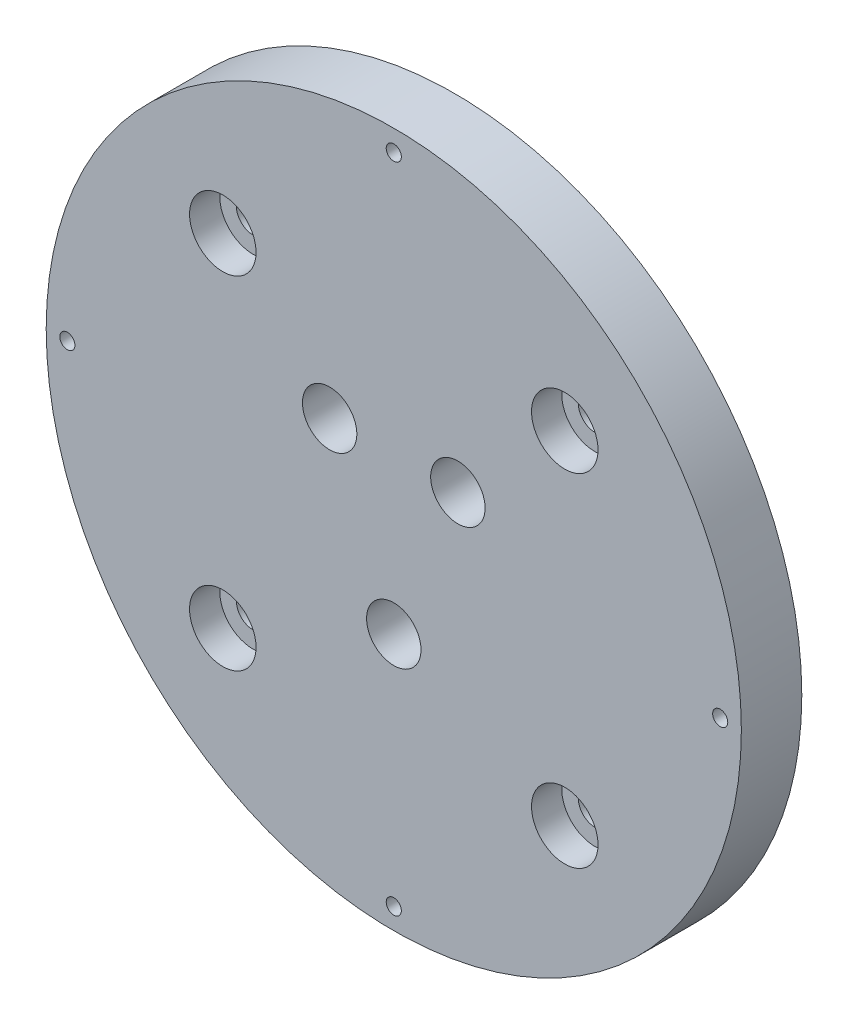
ISO-10303-21;
HEADER;
FILE_DESCRIPTION(('STEP AP214'),'2;1');
FILE_NAME('part.step','',(''),(''),'','','');
FILE_SCHEMA(('AUTOMOTIVE_DESIGN { 1 0 10303 214 1 1 1 1 }'));
ENDSEC;
DATA;
#1=APPLICATION_CONTEXT('core data for automotive mechanical design processes');
#2=APPLICATION_PROTOCOL_DEFINITION('international standard','automotive_design',2000,#1);
#3=PRODUCT_CONTEXT('',#1,'mechanical');
#4=PRODUCT('Part','Part','',(#3));
#5=PRODUCT_RELATED_PRODUCT_CATEGORY('part','',(#4));
#6=PRODUCT_DEFINITION_FORMATION('','',#4);
#7=PRODUCT_DEFINITION_CONTEXT('part definition',#1,'design');
#8=PRODUCT_DEFINITION('design','',#6,#7);
#9=PRODUCT_DEFINITION_SHAPE('','',#8);
#10=(LENGTH_UNIT() NAMED_UNIT(*) SI_UNIT(.MILLI.,.METRE.));
#11=(NAMED_UNIT(*) PLANE_ANGLE_UNIT() SI_UNIT($,.RADIAN.));
#12=(NAMED_UNIT(*) SI_UNIT($,.STERADIAN.) SOLID_ANGLE_UNIT());
#13=UNCERTAINTY_MEASURE_WITH_UNIT(LENGTH_MEASURE(1.E-05),#10,'distance_accuracy_value','');
#14=(GEOMETRIC_REPRESENTATION_CONTEXT(3) GLOBAL_UNCERTAINTY_ASSIGNED_CONTEXT((#13)) GLOBAL_UNIT_ASSIGNED_CONTEXT((#10,
#11,#12)) REPRESENTATION_CONTEXT('',''));
#15=CARTESIAN_POINT('',(0.,0.,0.));
#16=DIRECTION('',(0.,0.,1.));
#17=DIRECTION('',(1.,0.,0.));
#18=AXIS2_PLACEMENT_3D('',#15,#16,#17);
#19=CARTESIAN_POINT('',(0.,0.,0.));
#20=DIRECTION('',(0.,0.,1.));
#21=DIRECTION('',(1.,0.,0.));
#22=AXIS2_PLACEMENT_3D('',#19,#20,#21);
#23=PLANE('',#22);
#24=CARTESIAN_POINT('',(28.2842712474622,-28.2842712474616,0.));
#25=DIRECTION('',(0.,0.,1.));
#26=DIRECTION('',(1.,0.,0.));
#27=AXIS2_PLACEMENT_3D('',#24,#25,#26);
#28=CIRCLE('',#27,2.75000000000001);
#29=CARTESIAN_POINT('',(31.0342712474623,-28.2842712474616,0.));
#30=VERTEX_POINT('',#29);
#31=EDGE_CURVE('E156',#30,#30,#28,.T.);
#32=ORIENTED_EDGE('',*,*,#31,.T.);
#33=EDGE_LOOP('',(#32));
#34=FACE_BOUND('',#33,.T.);
#35=CARTESIAN_POINT('',(-28.2842712474618,-28.284271247462,0.));
#36=DIRECTION('',(0.,0.,1.));
#37=DIRECTION('',(1.,0.,0.));
#38=AXIS2_PLACEMENT_3D('',#35,#36,#37);
#39=CIRCLE('',#38,2.75000000000001);
#40=CARTESIAN_POINT('',(-25.5342712474618,-28.284271247462,0.));
#41=VERTEX_POINT('',#40);
#42=EDGE_CURVE('E160',#41,#41,#39,.T.);
#43=ORIENTED_EDGE('',*,*,#42,.T.);
#44=EDGE_LOOP('',(#43));
#45=FACE_BOUND('',#44,.T.);
#46=CARTESIAN_POINT('',(-28.2842712474621,28.2842712474617,0.));
#47=DIRECTION('',(0.,0.,1.));
#48=DIRECTION('',(1.,0.,0.));
#49=AXIS2_PLACEMENT_3D('',#46,#47,#48);
#50=CIRCLE('',#49,2.75000000000001);
#51=CARTESIAN_POINT('',(-25.534271247462,28.2842712474617,0.));
#52=VERTEX_POINT('',#51);
#53=EDGE_CURVE('E164',#52,#52,#50,.T.);
#54=ORIENTED_EDGE('',*,*,#53,.T.);
#55=EDGE_LOOP('',(#54));
#56=FACE_BOUND('',#55,.T.);
#57=CARTESIAN_POINT('',(28.2842712474618,28.284271247462,0.));
#58=DIRECTION('',(0.,0.,1.));
#59=DIRECTION('',(1.,0.,0.));
#60=AXIS2_PLACEMENT_3D('',#57,#58,#59);
#61=CIRCLE('',#60,2.75000000000001);
#62=CARTESIAN_POINT('',(31.0342712474619,28.284271247462,0.));
#63=VERTEX_POINT('',#62);
#64=EDGE_CURVE('E76',#63,#63,#61,.T.);
#65=ORIENTED_EDGE('',*,*,#64,.T.);
#66=EDGE_LOOP('',(#65));
#67=FACE_BOUND('',#66,.T.);
#68=CARTESIAN_POINT('',(-10.6066017177983,10.6066017177982,0.));
#69=DIRECTION('',(0.,0.,1.));
#70=DIRECTION('',(1.,0.,0.));
#71=AXIS2_PLACEMENT_3D('',#68,#69,#70);
#72=CIRCLE('',#71,4.5);
#73=CARTESIAN_POINT('',(-6.10660171779827,10.6066017177982,0.));
#74=VERTEX_POINT('',#73);
#75=EDGE_CURVE('E119',#74,#74,#72,.T.);
#76=ORIENTED_EDGE('',*,*,#75,.T.);
#77=EDGE_LOOP('',(#76));
#78=FACE_BOUND('',#77,.T.);
#79=CARTESIAN_POINT('',(10.6066017177982,10.6066017177982,0.));
#80=DIRECTION('',(0.,0.,1.));
#81=DIRECTION('',(1.,0.,0.));
#82=AXIS2_PLACEMENT_3D('',#79,#80,#81);
#83=CIRCLE('',#82,4.5);
#84=CARTESIAN_POINT('',(15.1066017177982,10.6066017177982,0.));
#85=VERTEX_POINT('',#84);
#86=EDGE_CURVE('E113',#85,#85,#83,.T.);
#87=ORIENTED_EDGE('',*,*,#86,.T.);
#88=EDGE_LOOP('',(#87));
#89=FACE_BOUND('',#88,.T.);
#90=CARTESIAN_POINT('',(0.,-15.,0.));
#91=DIRECTION('',(0.,0.,1.));
#92=DIRECTION('',(1.,0.,0.));
#93=AXIS2_PLACEMENT_3D('',#90,#91,#92);
#94=CIRCLE('',#93,4.5);
#95=CARTESIAN_POINT('',(4.5,-15.,0.));
#96=VERTEX_POINT('',#95);
#97=EDGE_CURVE('E107',#96,#96,#94,.T.);
#98=ORIENTED_EDGE('',*,*,#97,.T.);
#99=EDGE_LOOP('',(#98));
#100=FACE_BOUND('',#99,.T.);
#101=CARTESIAN_POINT('',(0.,0.,0.));
#102=DIRECTION('',(0.,0.,-1.));
#103=DIRECTION('',(-1.,0.,0.));
#104=AXIS2_PLACEMENT_3D('',#101,#102,#103);
#105=CIRCLE('',#104,53.);
#106=CARTESIAN_POINT('',(-53.,0.,0.));
#107=VERTEX_POINT('',#106);
#108=EDGE_CURVE('E94',#107,#107,#105,.T.);
#109=ORIENTED_EDGE('',*,*,#108,.T.);
#110=EDGE_LOOP('',(#109));
#111=FACE_BOUND('',#110,.T.);
#112=ADVANCED_FACE('F38',(#34,#45,#56,#67,#78,#89,#100,#111),#23,.F.);
#113=CARTESIAN_POINT('',(0.,0.,10.));
#114=DIRECTION('',(0.,0.,-1.));
#115=DIRECTION('',(-1.,0.,0.));
#116=AXIS2_PLACEMENT_3D('',#113,#114,#115);
#117=CYLINDRICAL_SURFACE('',#116,57.5);
#118=CARTESIAN_POINT('',(0.,0.,10.));
#119=DIRECTION('',(0.,0.,1.));
#120=DIRECTION('',(1.,0.,0.));
#121=AXIS2_PLACEMENT_3D('',#118,#119,#120);
#122=CIRCLE('',#121,57.5);
#123=CARTESIAN_POINT('',(57.5,0.,10.));
#124=VERTEX_POINT('',#123);
#125=EDGE_CURVE('E11',#124,#124,#122,.T.);
#126=ORIENTED_EDGE('',*,*,#125,.F.);
#127=EDGE_LOOP('',(#126));
#128=FACE_BOUND('',#127,.T.);
#129=CARTESIAN_POINT('',(0.,0.,0.));
#130=DIRECTION('',(0.,0.,1.));
#131=DIRECTION('',(1.,0.,0.));
#132=AXIS2_PLACEMENT_3D('',#129,#130,#131);
#133=CIRCLE('',#132,57.5);
#134=CARTESIAN_POINT('',(57.5,0.,0.));
#135=VERTEX_POINT('',#134);
#136=EDGE_CURVE('E42',#135,#135,#133,.T.);
#137=ORIENTED_EDGE('',*,*,#136,.T.);
#138=EDGE_LOOP('',(#137));
#139=FACE_BOUND('',#138,.T.);
#140=ADVANCED_FACE('F40',(#128,#139),#117,.T.);
#141=CARTESIAN_POINT('',(0.,0.,10.));
#142=DIRECTION('',(0.,0.,1.));
#143=DIRECTION('',(1.,0.,0.));
#144=AXIS2_PLACEMENT_3D('',#141,#142,#143);
#145=PLANE('',#144);
#146=CARTESIAN_POINT('',(28.2842712474622,-28.2842712474616,10.));
#147=DIRECTION('',(0.,0.,1.));
#148=DIRECTION('',(1.,0.,0.));
#149=AXIS2_PLACEMENT_3D('',#146,#147,#148);
#150=CIRCLE('',#149,5.50000000000001);
#151=CARTESIAN_POINT('',(33.7842712474623,-28.2842712474616,10.));
#152=VERTEX_POINT('',#151);
#153=EDGE_CURVE('E441',#152,#152,#150,.T.);
#154=ORIENTED_EDGE('',*,*,#153,.F.);
#155=EDGE_LOOP('',(#154));
#156=FACE_BOUND('',#155,.T.);
#157=CARTESIAN_POINT('',(-28.2842712474618,-28.284271247462,10.));
#158=DIRECTION('',(0.,0.,1.));
#159=DIRECTION('',(1.,0.,0.));
#160=AXIS2_PLACEMENT_3D('',#157,#158,#159);
#161=CIRCLE('',#160,5.50000000000001);
#162=CARTESIAN_POINT('',(-22.7842712474618,-28.284271247462,10.));
#163=VERTEX_POINT('',#162);
#164=EDGE_CURVE('E449',#163,#163,#161,.T.);
#165=ORIENTED_EDGE('',*,*,#164,.F.);
#166=EDGE_LOOP('',(#165));
#167=FACE_BOUND('',#166,.T.);
#168=CARTESIAN_POINT('',(-28.2842712474621,28.2842712474617,10.));
#169=DIRECTION('',(0.,0.,1.));
#170=DIRECTION('',(1.,0.,0.));
#171=AXIS2_PLACEMENT_3D('',#168,#169,#170);
#172=CIRCLE('',#171,5.50000000000001);
#173=CARTESIAN_POINT('',(-22.784271247462,28.2842712474617,10.));
#174=VERTEX_POINT('',#173);
#175=EDGE_CURVE('E459',#174,#174,#172,.T.);
#176=ORIENTED_EDGE('',*,*,#175,.F.);
#177=EDGE_LOOP('',(#176));
#178=FACE_BOUND('',#177,.T.);
#179=CARTESIAN_POINT('',(28.2842712474618,28.284271247462,10.));
#180=DIRECTION('',(0.,0.,1.));
#181=DIRECTION('',(1.,0.,0.));
#182=AXIS2_PLACEMENT_3D('',#179,#180,#181);
#183=CIRCLE('',#182,5.50000000000001);
#184=CARTESIAN_POINT('',(33.7842712474619,28.284271247462,10.));
#185=VERTEX_POINT('',#184);
#186=EDGE_CURVE('E469',#185,#185,#183,.T.);
#187=ORIENTED_EDGE('',*,*,#186,.F.);
#188=EDGE_LOOP('',(#187));
#189=FACE_BOUND('',#188,.T.);
#190=CARTESIAN_POINT('',(54.,5.65619976892588E-13,10.));
#191=DIRECTION('',(0.,0.,1.));
#192=DIRECTION('',(1.,0.,0.));
#193=AXIS2_PLACEMENT_3D('',#190,#191,#192);
#194=CIRCLE('',#193,1.25);
#195=CARTESIAN_POINT('',(55.25,5.65619976892588E-13,10.));
#196=VERTEX_POINT('',#195);
#197=EDGE_CURVE('E70',#196,#196,#194,.T.);
#198=ORIENTED_EDGE('',*,*,#197,.F.);
#199=EDGE_LOOP('',(#198));
#200=FACE_BOUND('',#199,.T.);
#201=CARTESIAN_POINT('',(0.,-54.,10.));
#202=DIRECTION('',(0.,0.,1.));
#203=DIRECTION('',(1.,0.,0.));
#204=AXIS2_PLACEMENT_3D('',#201,#202,#203);
#205=CIRCLE('',#204,1.25);
#206=CARTESIAN_POINT('',(1.25,-54.,10.));
#207=VERTEX_POINT('',#206);
#208=EDGE_CURVE('E69',#207,#207,#205,.T.);
#209=ORIENTED_EDGE('',*,*,#208,.F.);
#210=EDGE_LOOP('',(#209));
#211=FACE_BOUND('',#210,.T.);
#212=CARTESIAN_POINT('',(-54.,-1.88539992297529E-13,10.));
#213=DIRECTION('',(0.,0.,1.));
#214=DIRECTION('',(1.,0.,0.));
#215=AXIS2_PLACEMENT_3D('',#212,#213,#214);
#216=CIRCLE('',#215,1.25);
#217=CARTESIAN_POINT('',(-52.75,-1.88539992297529E-13,10.));
#218=VERTEX_POINT('',#217);
#219=EDGE_CURVE('E82',#218,#218,#216,.T.);
#220=ORIENTED_EDGE('',*,*,#219,.F.);
#221=EDGE_LOOP('',(#220));
#222=FACE_BOUND('',#221,.T.);
#223=CARTESIAN_POINT('',(0.,54.,10.));
#224=DIRECTION('',(0.,0.,1.));
#225=DIRECTION('',(1.,0.,0.));
#226=AXIS2_PLACEMENT_3D('',#223,#224,#225);
#227=CIRCLE('',#226,1.25);
#228=CARTESIAN_POINT('',(1.25,54.,10.));
#229=VERTEX_POINT('',#228);
#230=EDGE_CURVE('E88',#229,#229,#227,.T.);
#231=ORIENTED_EDGE('',*,*,#230,.F.);
#232=EDGE_LOOP('',(#231));
#233=FACE_BOUND('',#232,.T.);
#234=CARTESIAN_POINT('',(0.,-15.,10.));
#235=DIRECTION('',(0.,0.,1.));
#236=DIRECTION('',(1.,0.,0.));
#237=AXIS2_PLACEMENT_3D('',#234,#235,#236);
#238=CIRCLE('',#237,4.5);
#239=CARTESIAN_POINT('',(4.5,-15.,10.));
#240=VERTEX_POINT('',#239);
#241=EDGE_CURVE('E110',#240,#240,#238,.T.);
#242=ORIENTED_EDGE('',*,*,#241,.F.);
#243=EDGE_LOOP('',(#242));
#244=FACE_BOUND('',#243,.T.);
#245=CARTESIAN_POINT('',(10.6066017177982,10.6066017177982,10.));
#246=DIRECTION('',(0.,0.,1.));
#247=DIRECTION('',(1.,0.,0.));
#248=AXIS2_PLACEMENT_3D('',#245,#246,#247);
#249=CIRCLE('',#248,4.5);
#250=CARTESIAN_POINT('',(15.1066017177982,10.6066017177982,10.));
#251=VERTEX_POINT('',#250);
#252=EDGE_CURVE('E116',#251,#251,#249,.T.);
#253=ORIENTED_EDGE('',*,*,#252,.F.);
#254=EDGE_LOOP('',(#253));
#255=FACE_BOUND('',#254,.T.);
#256=CARTESIAN_POINT('',(-10.6066017177983,10.6066017177982,10.));
#257=DIRECTION('',(0.,0.,1.));
#258=DIRECTION('',(1.,0.,0.));
#259=AXIS2_PLACEMENT_3D('',#256,#257,#258);
#260=CIRCLE('',#259,4.5);
#261=CARTESIAN_POINT('',(-6.10660171779827,10.6066017177982,10.));
#262=VERTEX_POINT('',#261);
#263=EDGE_CURVE('E104',#262,#262,#260,.T.);
#264=ORIENTED_EDGE('',*,*,#263,.F.);
#265=EDGE_LOOP('',(#264));
#266=FACE_BOUND('',#265,.T.);
#267=ORIENTED_EDGE('',*,*,#125,.T.);
#268=EDGE_LOOP('',(#267));
#269=FACE_BOUND('',#268,.T.);
#270=ADVANCED_FACE('F127',(#156,#167,#178,#189,#200,#211,#222,#233,#244,#255,#266,#269),#145,.T.);
#271=CARTESIAN_POINT('',(0.,0.,0.));
#272=DIRECTION('',(0.,0.,-1.));
#273=DIRECTION('',(-1.,0.,0.));
#274=AXIS2_PLACEMENT_3D('',#271,#272,#273);
#275=CIRCLE('',#274,55.);
#276=CARTESIAN_POINT('',(-55.,0.,0.));
#277=VERTEX_POINT('',#276);
#278=EDGE_CURVE('E98',#277,#277,#275,.T.);
#279=ORIENTED_EDGE('',*,*,#278,.F.);
#280=EDGE_LOOP('',(#279));
#281=FACE_BOUND('',#280,.T.);
#282=ORIENTED_EDGE('',*,*,#136,.F.);
#283=EDGE_LOOP('',(#282));
#284=FACE_BOUND('',#283,.T.);
#285=ADVANCED_FACE('F130',(#281,#284),#23,.F.);
#286=CARTESIAN_POINT('',(-10.6066017177983,10.6066017177982,0.));
#287=DIRECTION('',(0.,0.,1.));
#288=DIRECTION('',(1.,0.,0.));
#289=AXIS2_PLACEMENT_3D('',#286,#287,#288);
#290=CYLINDRICAL_SURFACE('',#289,4.5);
#291=ORIENTED_EDGE('',*,*,#75,.F.);
#292=EDGE_LOOP('',(#291));
#293=FACE_BOUND('',#292,.T.);
#294=ORIENTED_EDGE('',*,*,#263,.T.);
#295=EDGE_LOOP('',(#294));
#296=FACE_BOUND('',#295,.T.);
#297=ADVANCED_FACE('F125',(#293,#296),#290,.F.);
#298=CARTESIAN_POINT('',(10.6066017177982,10.6066017177982,0.));
#299=DIRECTION('',(0.,0.,1.));
#300=DIRECTION('',(1.,0.,0.));
#301=AXIS2_PLACEMENT_3D('',#298,#299,#300);
#302=CYLINDRICAL_SURFACE('',#301,4.5);
#303=ORIENTED_EDGE('',*,*,#86,.F.);
#304=EDGE_LOOP('',(#303));
#305=FACE_BOUND('',#304,.T.);
#306=ORIENTED_EDGE('',*,*,#252,.T.);
#307=EDGE_LOOP('',(#306));
#308=FACE_BOUND('',#307,.T.);
#309=ADVANCED_FACE('F145',(#305,#308),#302,.F.);
#310=CARTESIAN_POINT('',(0.,-15.,0.));
#311=DIRECTION('',(0.,0.,1.));
#312=DIRECTION('',(1.,0.,0.));
#313=AXIS2_PLACEMENT_3D('',#310,#311,#312);
#314=CYLINDRICAL_SURFACE('',#313,4.5);
#315=ORIENTED_EDGE('',*,*,#97,.F.);
#316=EDGE_LOOP('',(#315));
#317=FACE_BOUND('',#316,.T.);
#318=ORIENTED_EDGE('',*,*,#241,.T.);
#319=EDGE_LOOP('',(#318));
#320=FACE_BOUND('',#319,.T.);
#321=ADVANCED_FACE('F195',(#317,#320),#314,.F.);
#322=CARTESIAN_POINT('',(0.,0.,1.27));
#323=DIRECTION('',(0.,0.,-1.));
#324=DIRECTION('',(-1.,0.,0.));
#325=AXIS2_PLACEMENT_3D('',#322,#323,#324);
#326=CYLINDRICAL_SURFACE('',#325,55.);
#327=CARTESIAN_POINT('',(0.,0.,1.27));
#328=DIRECTION('',(0.,0.,-1.));
#329=DIRECTION('',(-1.,0.,0.));
#330=AXIS2_PLACEMENT_3D('',#327,#328,#329);
#331=CIRCLE('',#330,55.);
#332=CARTESIAN_POINT('',(-55.,0.,1.27));
#333=VERTEX_POINT('',#332);
#334=EDGE_CURVE('E101',#333,#333,#331,.T.);
#335=ORIENTED_EDGE('',*,*,#334,.F.);
#336=EDGE_LOOP('',(#335));
#337=FACE_BOUND('',#336,.T.);
#338=ORIENTED_EDGE('',*,*,#278,.T.);
#339=EDGE_LOOP('',(#338));
#340=FACE_BOUND('',#339,.T.);
#341=ADVANCED_FACE('F188',(#337,#340),#326,.F.);
#342=CARTESIAN_POINT('',(0.,0.,1.27));
#343=DIRECTION('',(0.,0.,-1.));
#344=DIRECTION('',(-1.,0.,0.));
#345=AXIS2_PLACEMENT_3D('',#342,#343,#344);
#346=PLANE('',#345);
#347=CARTESIAN_POINT('',(0.,0.,1.27));
#348=DIRECTION('',(0.,0.,-1.));
#349=DIRECTION('',(-1.,0.,0.));
#350=AXIS2_PLACEMENT_3D('',#347,#348,#349);
#351=CIRCLE('',#350,53.);
#352=CARTESIAN_POINT('',(-53.,0.,1.27));
#353=VERTEX_POINT('',#352);
#354=EDGE_CURVE('E95',#353,#353,#351,.T.);
#355=ORIENTED_EDGE('',*,*,#354,.F.);
#356=EDGE_LOOP('',(#355));
#357=FACE_BOUND('',#356,.T.);
#358=ORIENTED_EDGE('',*,*,#334,.T.);
#359=EDGE_LOOP('',(#358));
#360=FACE_BOUND('',#359,.T.);
#361=ADVANCED_FACE('F179',(#357,#360),#346,.T.);
#362=CARTESIAN_POINT('',(0.,0.,1.27));
#363=DIRECTION('',(0.,0.,-1.));
#364=DIRECTION('',(-1.,0.,0.));
#365=AXIS2_PLACEMENT_3D('',#362,#363,#364);
#366=CYLINDRICAL_SURFACE('',#365,53.);
#367=ORIENTED_EDGE('',*,*,#354,.T.);
#368=EDGE_LOOP('',(#367));
#369=FACE_BOUND('',#368,.T.);
#370=ORIENTED_EDGE('',*,*,#108,.F.);
#371=EDGE_LOOP('',(#370));
#372=FACE_BOUND('',#371,.T.);
#373=ADVANCED_FACE('F176',(#369,#372),#366,.T.);
#374=CARTESIAN_POINT('',(0.,54.,3.5));
#375=DIRECTION('',(0.,0.,1.));
#376=DIRECTION('',(1.,0.,0.));
#377=AXIS2_PLACEMENT_3D('',#374,#375,#376);
#378=CONICAL_SURFACE('',#377,1.25,1.02974425867665);
#379=CARTESIAN_POINT('',(0.,54.,2.74892422621555));
#380=VERTEX_POINT('',#379);
#381=VERTEX_LOOP('',#380);
#382=FACE_BOUND('',#381,.T.);
#383=CARTESIAN_POINT('',(0.,54.,3.5));
#384=DIRECTION('',(0.,0.,1.));
#385=DIRECTION('',(1.,0.,0.));
#386=AXIS2_PLACEMENT_3D('',#383,#384,#385);
#387=CIRCLE('',#386,1.25);
#388=CARTESIAN_POINT('',(1.25,54.,3.5));
#389=VERTEX_POINT('',#388);
#390=EDGE_CURVE('E91',#389,#389,#387,.T.);
#391=ORIENTED_EDGE('',*,*,#390,.T.);
#392=EDGE_LOOP('',(#391));
#393=FACE_BOUND('',#392,.T.);
#394=ADVANCED_FACE('F178',(#382,#393),#378,.F.);
#395=CARTESIAN_POINT('',(0.,54.,10.));
#396=DIRECTION('',(0.,0.,1.));
#397=DIRECTION('',(1.,0.,0.));
#398=AXIS2_PLACEMENT_3D('',#395,#396,#397);
#399=CYLINDRICAL_SURFACE('',#398,1.25);
#400=ORIENTED_EDGE('',*,*,#390,.F.);
#401=EDGE_LOOP('',(#400));
#402=FACE_BOUND('',#401,.T.);
#403=ORIENTED_EDGE('',*,*,#230,.T.);
#404=EDGE_LOOP('',(#403));
#405=FACE_BOUND('',#404,.T.);
#406=ADVANCED_FACE('F186',(#402,#405),#399,.F.);
#407=CARTESIAN_POINT('',(-54.,-1.88539992297529E-13,3.5));
#408=DIRECTION('',(0.,0.,1.));
#409=DIRECTION('',(1.,0.,0.));
#410=AXIS2_PLACEMENT_3D('',#407,#408,#409);
#411=CONICAL_SURFACE('',#410,1.25,1.02974425867666);
#412=CARTESIAN_POINT('',(-54.,-1.88539992297529E-13,2.74892422621555));
#413=VERTEX_POINT('',#412);
#414=VERTEX_LOOP('',#413);
#415=FACE_BOUND('',#414,.T.);
#416=CARTESIAN_POINT('',(-54.,-1.88539992297529E-13,3.5));
#417=DIRECTION('',(0.,0.,1.));
#418=DIRECTION('',(1.,0.,0.));
#419=AXIS2_PLACEMENT_3D('',#416,#417,#418);
#420=CIRCLE('',#419,1.25);
#421=CARTESIAN_POINT('',(-52.75,-1.88539992297529E-13,3.5));
#422=VERTEX_POINT('',#421);
#423=EDGE_CURVE('E85',#422,#422,#420,.T.);
#424=ORIENTED_EDGE('',*,*,#423,.T.);
#425=EDGE_LOOP('',(#424));
#426=FACE_BOUND('',#425,.T.);
#427=ADVANCED_FACE('F241',(#415,#426),#411,.F.);
#428=CARTESIAN_POINT('',(-54.,-1.88539992297529E-13,10.));
#429=DIRECTION('',(0.,0.,1.));
#430=DIRECTION('',(1.,0.,0.));
#431=AXIS2_PLACEMENT_3D('',#428,#429,#430);
#432=CYLINDRICAL_SURFACE('',#431,1.25);
#433=ORIENTED_EDGE('',*,*,#423,.F.);
#434=EDGE_LOOP('',(#433));
#435=FACE_BOUND('',#434,.T.);
#436=ORIENTED_EDGE('',*,*,#219,.T.);
#437=EDGE_LOOP('',(#436));
#438=FACE_BOUND('',#437,.T.);
#439=ADVANCED_FACE('F252',(#435,#438),#432,.F.);
#440=CARTESIAN_POINT('',(0.,-54.,3.5));
#441=DIRECTION('',(0.,0.,1.));
#442=DIRECTION('',(1.,0.,0.));
#443=AXIS2_PLACEMENT_3D('',#440,#441,#442);
#444=CONICAL_SURFACE('',#443,1.25,1.02974425867665);
#445=CARTESIAN_POINT('',(0.,-54.,2.74892422621555));
#446=VERTEX_POINT('',#445);
#447=VERTEX_LOOP('',#446);
#448=FACE_BOUND('',#447,.T.);
#449=CARTESIAN_POINT('',(0.,-54.,3.5));
#450=DIRECTION('',(0.,0.,1.));
#451=DIRECTION('',(1.,0.,0.));
#452=AXIS2_PLACEMENT_3D('',#449,#450,#451);
#453=CIRCLE('',#452,1.25);
#454=CARTESIAN_POINT('',(1.25,-54.,3.5));
#455=VERTEX_POINT('',#454);
#456=EDGE_CURVE('E73',#455,#455,#453,.T.);
#457=ORIENTED_EDGE('',*,*,#456,.T.);
#458=EDGE_LOOP('',(#457));
#459=FACE_BOUND('',#458,.T.);
#460=ADVANCED_FACE('F262',(#448,#459),#444,.F.);
#461=CARTESIAN_POINT('',(0.,-54.,10.));
#462=DIRECTION('',(0.,0.,1.));
#463=DIRECTION('',(1.,0.,0.));
#464=AXIS2_PLACEMENT_3D('',#461,#462,#463);
#465=CYLINDRICAL_SURFACE('',#464,1.25);
#466=ORIENTED_EDGE('',*,*,#456,.F.);
#467=EDGE_LOOP('',(#466));
#468=FACE_BOUND('',#467,.T.);
#469=ORIENTED_EDGE('',*,*,#208,.T.);
#470=EDGE_LOOP('',(#469));
#471=FACE_BOUND('',#470,.T.);
#472=ADVANCED_FACE('F63',(#468,#471),#465,.F.);
#473=CARTESIAN_POINT('',(54.,5.65619976892588E-13,3.5));
#474=DIRECTION('',(0.,0.,1.));
#475=DIRECTION('',(1.,0.,0.));
#476=AXIS2_PLACEMENT_3D('',#473,#474,#475);
#477=CONICAL_SURFACE('',#476,1.25,1.02974425867666);
#478=CARTESIAN_POINT('',(54.,5.65619976892588E-13,2.74892422621555));
#479=VERTEX_POINT('',#478);
#480=VERTEX_LOOP('',#479);
#481=FACE_BOUND('',#480,.T.);
#482=CARTESIAN_POINT('',(54.,5.65619976892588E-13,3.5));
#483=DIRECTION('',(0.,0.,1.));
#484=DIRECTION('',(1.,0.,0.));
#485=AXIS2_PLACEMENT_3D('',#482,#483,#484);
#486=CIRCLE('',#485,1.25);
#487=CARTESIAN_POINT('',(55.25,5.65619976892588E-13,3.5));
#488=VERTEX_POINT('',#487);
#489=EDGE_CURVE('E67',#488,#488,#486,.T.);
#490=ORIENTED_EDGE('',*,*,#489,.T.);
#491=EDGE_LOOP('',(#490));
#492=FACE_BOUND('',#491,.T.);
#493=ADVANCED_FACE('F59',(#481,#492),#477,.F.);
#494=CARTESIAN_POINT('',(54.,5.65619976892588E-13,10.));
#495=DIRECTION('',(0.,0.,1.));
#496=DIRECTION('',(1.,0.,0.));
#497=AXIS2_PLACEMENT_3D('',#494,#495,#496);
#498=CYLINDRICAL_SURFACE('',#497,1.25);
#499=ORIENTED_EDGE('',*,*,#489,.F.);
#500=EDGE_LOOP('',(#499));
#501=FACE_BOUND('',#500,.T.);
#502=ORIENTED_EDGE('',*,*,#197,.T.);
#503=EDGE_LOOP('',(#502));
#504=FACE_BOUND('',#503,.T.);
#505=ADVANCED_FACE('F62',(#501,#504),#498,.F.);
#506=CARTESIAN_POINT('',(28.2842712474618,28.284271247462,10.));
#507=DIRECTION('',(0.,0.,1.));
#508=DIRECTION('',(1.,0.,0.));
#509=AXIS2_PLACEMENT_3D('',#506,#507,#508);
#510=CYLINDRICAL_SURFACE('',#509,2.75000000000001);
#511=ORIENTED_EDGE('',*,*,#64,.F.);
#512=EDGE_LOOP('',(#511));
#513=FACE_BOUND('',#512,.T.);
#514=CARTESIAN_POINT('',(28.2842712474618,28.284271247462,5.));
#515=DIRECTION('',(0.,0.,1.));
#516=DIRECTION('',(1.,0.,0.));
#517=AXIS2_PLACEMENT_3D('',#514,#515,#516);
#518=CIRCLE('',#517,2.75000000000001);
#519=CARTESIAN_POINT('',(31.0342712474619,28.284271247462,5.));
#520=VERTEX_POINT('',#519);
#521=EDGE_CURVE('E475',#520,#520,#518,.T.);
#522=ORIENTED_EDGE('',*,*,#521,.T.);
#523=EDGE_LOOP('',(#522));
#524=FACE_BOUND('',#523,.T.);
#525=ADVANCED_FACE('F299',(#513,#524),#510,.F.);
#526=CARTESIAN_POINT('',(31.0342712474619,28.284271247462,5.));
#527=DIRECTION('',(0.,0.,-1.));
#528=DIRECTION('',(-1.,0.,0.));
#529=AXIS2_PLACEMENT_3D('',#526,#527,#528);
#530=PLANE('',#529);
#531=ORIENTED_EDGE('',*,*,#521,.F.);
#532=EDGE_LOOP('',(#531));
#533=FACE_BOUND('',#532,.T.);
#534=CARTESIAN_POINT('',(28.2842712474618,28.284271247462,5.));
#535=DIRECTION('',(0.,0.,1.));
#536=DIRECTION('',(1.,0.,0.));
#537=AXIS2_PLACEMENT_3D('',#534,#535,#536);
#538=CIRCLE('',#537,5.50000000000002);
#539=CARTESIAN_POINT('',(33.7842712474619,28.284271247462,5.));
#540=VERTEX_POINT('',#539);
#541=EDGE_CURVE('E472',#540,#540,#538,.T.);
#542=ORIENTED_EDGE('',*,*,#541,.T.);
#543=EDGE_LOOP('',(#542));
#544=FACE_BOUND('',#543,.T.);
#545=ADVANCED_FACE('F309',(#533,#544),#530,.F.);
#546=CARTESIAN_POINT('',(28.2842712474618,28.284271247462,10.));
#547=DIRECTION('',(0.,0.,1.));
#548=DIRECTION('',(1.,0.,0.));
#549=AXIS2_PLACEMENT_3D('',#546,#547,#548);
#550=CYLINDRICAL_SURFACE('',#549,5.50000000000001);
#551=ORIENTED_EDGE('',*,*,#541,.F.);
#552=EDGE_LOOP('',(#551));
#553=FACE_BOUND('',#552,.T.);
#554=ORIENTED_EDGE('',*,*,#186,.T.);
#555=EDGE_LOOP('',(#554));
#556=FACE_BOUND('',#555,.T.);
#557=ADVANCED_FACE('F319',(#553,#556),#550,.F.);
#558=CARTESIAN_POINT('',(-28.2842712474621,28.2842712474617,10.));
#559=DIRECTION('',(0.,0.,1.));
#560=DIRECTION('',(1.,0.,0.));
#561=AXIS2_PLACEMENT_3D('',#558,#559,#560);
#562=CYLINDRICAL_SURFACE('',#561,2.75000000000001);
#563=ORIENTED_EDGE('',*,*,#53,.F.);
#564=EDGE_LOOP('',(#563));
#565=FACE_BOUND('',#564,.T.);
#566=CARTESIAN_POINT('',(-28.2842712474621,28.2842712474617,5.));
#567=DIRECTION('',(0.,0.,1.));
#568=DIRECTION('',(1.,0.,0.));
#569=AXIS2_PLACEMENT_3D('',#566,#567,#568);
#570=CIRCLE('',#569,2.75000000000001);
#571=CARTESIAN_POINT('',(-25.534271247462,28.2842712474617,5.));
#572=VERTEX_POINT('',#571);
#573=EDGE_CURVE('E465',#572,#572,#570,.T.);
#574=ORIENTED_EDGE('',*,*,#573,.T.);
#575=EDGE_LOOP('',(#574));
#576=FACE_BOUND('',#575,.T.);
#577=ADVANCED_FACE('F328',(#565,#576),#562,.F.);
#578=CARTESIAN_POINT('',(-25.534271247462,28.2842712474617,5.));
#579=DIRECTION('',(0.,0.,-1.));
#580=DIRECTION('',(-1.,0.,0.));
#581=AXIS2_PLACEMENT_3D('',#578,#579,#580);
#582=PLANE('',#581);
#583=ORIENTED_EDGE('',*,*,#573,.F.);
#584=EDGE_LOOP('',(#583));
#585=FACE_BOUND('',#584,.T.);
#586=CARTESIAN_POINT('',(-28.2842712474621,28.2842712474617,5.));
#587=DIRECTION('',(0.,0.,1.));
#588=DIRECTION('',(1.,0.,0.));
#589=AXIS2_PLACEMENT_3D('',#586,#587,#588);
#590=CIRCLE('',#589,5.50000000000001);
#591=CARTESIAN_POINT('',(-22.784271247462,28.2842712474617,5.));
#592=VERTEX_POINT('',#591);
#593=EDGE_CURVE('E462',#592,#592,#590,.T.);
#594=ORIENTED_EDGE('',*,*,#593,.T.);
#595=EDGE_LOOP('',(#594));
#596=FACE_BOUND('',#595,.T.);
#597=ADVANCED_FACE('F351',(#585,#596),#582,.F.);
#598=CARTESIAN_POINT('',(-28.2842712474621,28.2842712474617,10.));
#599=DIRECTION('',(0.,0.,1.));
#600=DIRECTION('',(1.,0.,0.));
#601=AXIS2_PLACEMENT_3D('',#598,#599,#600);
#602=CYLINDRICAL_SURFACE('',#601,5.50000000000001);
#603=ORIENTED_EDGE('',*,*,#593,.F.);
#604=EDGE_LOOP('',(#603));
#605=FACE_BOUND('',#604,.T.);
#606=ORIENTED_EDGE('',*,*,#175,.T.);
#607=EDGE_LOOP('',(#606));
#608=FACE_BOUND('',#607,.T.);
#609=ADVANCED_FACE('F361',(#605,#608),#602,.F.);
#610=CARTESIAN_POINT('',(-28.2842712474618,-28.284271247462,10.));
#611=DIRECTION('',(0.,0.,1.));
#612=DIRECTION('',(1.,0.,0.));
#613=AXIS2_PLACEMENT_3D('',#610,#611,#612);
#614=CYLINDRICAL_SURFACE('',#613,2.75000000000001);
#615=ORIENTED_EDGE('',*,*,#42,.F.);
#616=EDGE_LOOP('',(#615));
#617=FACE_BOUND('',#616,.T.);
#618=CARTESIAN_POINT('',(-28.2842712474618,-28.284271247462,5.));
#619=DIRECTION('',(0.,0.,1.));
#620=DIRECTION('',(1.,0.,0.));
#621=AXIS2_PLACEMENT_3D('',#618,#619,#620);
#622=CIRCLE('',#621,2.75000000000001);
#623=CARTESIAN_POINT('',(-25.5342712474618,-28.284271247462,5.));
#624=VERTEX_POINT('',#623);
#625=EDGE_CURVE('E455',#624,#624,#622,.T.);
#626=ORIENTED_EDGE('',*,*,#625,.T.);
#627=EDGE_LOOP('',(#626));
#628=FACE_BOUND('',#627,.T.);
#629=ADVANCED_FACE('F371',(#617,#628),#614,.F.);
#630=CARTESIAN_POINT('',(-25.5342712474618,-28.284271247462,5.));
#631=DIRECTION('',(0.,0.,-1.));
#632=DIRECTION('',(-1.,0.,0.));
#633=AXIS2_PLACEMENT_3D('',#630,#631,#632);
#634=PLANE('',#633);
#635=ORIENTED_EDGE('',*,*,#625,.F.);
#636=EDGE_LOOP('',(#635));
#637=FACE_BOUND('',#636,.T.);
#638=CARTESIAN_POINT('',(-28.2842712474618,-28.284271247462,5.));
#639=DIRECTION('',(0.,0.,1.));
#640=DIRECTION('',(1.,0.,0.));
#641=AXIS2_PLACEMENT_3D('',#638,#639,#640);
#642=CIRCLE('',#641,5.50000000000002);
#643=CARTESIAN_POINT('',(-22.7842712474618,-28.284271247462,5.));
#644=VERTEX_POINT('',#643);
#645=EDGE_CURVE('E452',#644,#644,#642,.T.);
#646=ORIENTED_EDGE('',*,*,#645,.T.);
#647=EDGE_LOOP('',(#646));
#648=FACE_BOUND('',#647,.T.);
#649=ADVANCED_FACE('F381',(#637,#648),#634,.F.);
#650=CARTESIAN_POINT('',(-28.2842712474618,-28.284271247462,10.));
#651=DIRECTION('',(0.,0.,1.));
#652=DIRECTION('',(1.,0.,0.));
#653=AXIS2_PLACEMENT_3D('',#650,#651,#652);
#654=CYLINDRICAL_SURFACE('',#653,5.50000000000001);
#655=ORIENTED_EDGE('',*,*,#645,.F.);
#656=EDGE_LOOP('',(#655));
#657=FACE_BOUND('',#656,.T.);
#658=ORIENTED_EDGE('',*,*,#164,.T.);
#659=EDGE_LOOP('',(#658));
#660=FACE_BOUND('',#659,.T.);
#661=ADVANCED_FACE('F391',(#657,#660),#654,.F.);
#662=CARTESIAN_POINT('',(28.2842712474622,-28.2842712474616,10.));
#663=DIRECTION('',(0.,0.,1.));
#664=DIRECTION('',(1.,0.,0.));
#665=AXIS2_PLACEMENT_3D('',#662,#663,#664);
#666=CYLINDRICAL_SURFACE('',#665,2.75000000000001);
#667=ORIENTED_EDGE('',*,*,#31,.F.);
#668=EDGE_LOOP('',(#667));
#669=FACE_BOUND('',#668,.T.);
#670=CARTESIAN_POINT('',(28.2842712474622,-28.2842712474616,5.));
#671=DIRECTION('',(0.,0.,1.));
#672=DIRECTION('',(1.,0.,0.));
#673=AXIS2_PLACEMENT_3D('',#670,#671,#672);
#674=CIRCLE('',#673,2.75000000000001);
#675=CARTESIAN_POINT('',(31.0342712474623,-28.2842712474616,5.));
#676=VERTEX_POINT('',#675);
#677=EDGE_CURVE('E443',#676,#676,#674,.T.);
#678=ORIENTED_EDGE('',*,*,#677,.T.);
#679=EDGE_LOOP('',(#678));
#680=FACE_BOUND('',#679,.T.);
#681=ADVANCED_FACE('F401',(#669,#680),#666,.F.);
#682=CARTESIAN_POINT('',(31.0342712474623,-28.2842712474616,5.));
#683=DIRECTION('',(0.,0.,-1.));
#684=DIRECTION('',(-1.,0.,0.));
#685=AXIS2_PLACEMENT_3D('',#682,#683,#684);
#686=PLANE('',#685);
#687=ORIENTED_EDGE('',*,*,#677,.F.);
#688=EDGE_LOOP('',(#687));
#689=FACE_BOUND('',#688,.T.);
#690=CARTESIAN_POINT('',(28.2842712474622,-28.2842712474616,5.));
#691=DIRECTION('',(0.,0.,1.));
#692=DIRECTION('',(1.,0.,0.));
#693=AXIS2_PLACEMENT_3D('',#690,#691,#692);
#694=CIRCLE('',#693,5.50000000000002);
#695=CARTESIAN_POINT('',(33.7842712474623,-28.2842712474616,5.));
#696=VERTEX_POINT('',#695);
#697=EDGE_CURVE('E438',#696,#696,#694,.T.);
#698=ORIENTED_EDGE('',*,*,#697,.T.);
#699=EDGE_LOOP('',(#698));
#700=FACE_BOUND('',#699,.T.);
#701=ADVANCED_FACE('F411',(#689,#700),#686,.F.);
#702=CARTESIAN_POINT('',(28.2842712474622,-28.2842712474616,10.));
#703=DIRECTION('',(0.,0.,1.));
#704=DIRECTION('',(1.,0.,0.));
#705=AXIS2_PLACEMENT_3D('',#702,#703,#704);
#706=CYLINDRICAL_SURFACE('',#705,5.50000000000001);
#707=ORIENTED_EDGE('',*,*,#697,.F.);
#708=EDGE_LOOP('',(#707));
#709=FACE_BOUND('',#708,.T.);
#710=ORIENTED_EDGE('',*,*,#153,.T.);
#711=EDGE_LOOP('',(#710));
#712=FACE_BOUND('',#711,.T.);
#713=ADVANCED_FACE('F421',(#709,#712),#706,.F.);
#714=CLOSED_SHELL('',(#112,#140,#270,#285,#297,#309,#321,#341,#361,#373,#394,#406,#427,#439,
#460,#472,#493,#505,#525,#545,#557,#577,#597,#609,#629,#649,#661,#681,#701,#713));
#715=MANIFOLD_SOLID_BREP('B2',#714);
#716=ADVANCED_BREP_SHAPE_REPRESENTATION('',(#18,#715),#14);
#717=SHAPE_DEFINITION_REPRESENTATION(#9,#716);
ENDSEC;
END-ISO-10303-21;
